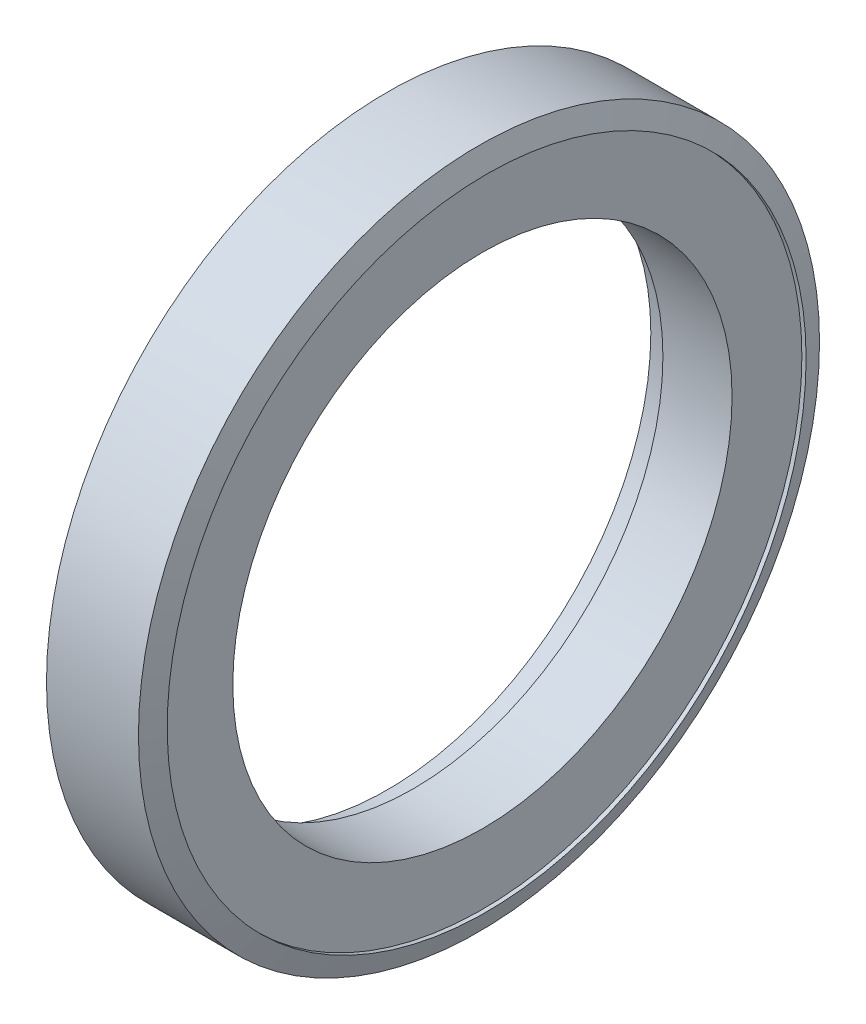
ISO-10303-21;
HEADER;
FILE_DESCRIPTION(('STEP AP214'),'2;1');
FILE_NAME('part.step','',(''),(''),'','','');
FILE_SCHEMA(('AUTOMOTIVE_DESIGN { 1 0 10303 214 1 1 1 1 }'));
ENDSEC;
DATA;
#1=APPLICATION_CONTEXT('core data for automotive mechanical design processes');
#2=APPLICATION_PROTOCOL_DEFINITION('international standard','automotive_design',2000,#1);
#3=PRODUCT_CONTEXT('',#1,'mechanical');
#4=PRODUCT('Part','Part','',(#3));
#5=PRODUCT_RELATED_PRODUCT_CATEGORY('part','',(#4));
#6=PRODUCT_DEFINITION_FORMATION('','',#4);
#7=PRODUCT_DEFINITION_CONTEXT('part definition',#1,'design');
#8=PRODUCT_DEFINITION('design','',#6,#7);
#9=PRODUCT_DEFINITION_SHAPE('','',#8);
#10=(LENGTH_UNIT() NAMED_UNIT(*) SI_UNIT(.MILLI.,.METRE.));
#11=(NAMED_UNIT(*) PLANE_ANGLE_UNIT() SI_UNIT($,.RADIAN.));
#12=(NAMED_UNIT(*) SI_UNIT($,.STERADIAN.) SOLID_ANGLE_UNIT());
#13=UNCERTAINTY_MEASURE_WITH_UNIT(LENGTH_MEASURE(1.E-05),#10,'distance_accuracy_value','');
#14=(GEOMETRIC_REPRESENTATION_CONTEXT(3) GLOBAL_UNCERTAINTY_ASSIGNED_CONTEXT((#13)) GLOBAL_UNIT_ASSIGNED_CONTEXT((#10,
#11,#12)) REPRESENTATION_CONTEXT('',''));
#15=CARTESIAN_POINT('',(0.,0.,0.));
#16=DIRECTION('',(0.,0.,1.));
#17=DIRECTION('',(1.,0.,0.));
#18=AXIS2_PLACEMENT_3D('',#15,#16,#17);
#19=CARTESIAN_POINT('',(7.3524999999999,0.,0.));
#20=DIRECTION('',(1.,0.,0.));
#21=DIRECTION('',(0.,0.,-1.));
#22=AXIS2_PLACEMENT_3D('',#19,#20,#21);
#23=CYLINDRICAL_SURFACE('',#22,30.1625);
#24=CARTESIAN_POINT('',(11.5299999999998,0.,0.));
#25=DIRECTION('',(1.,0.,0.));
#26=DIRECTION('',(0.,0.,-1.));
#27=AXIS2_PLACEMENT_3D('',#24,#25,#26);
#28=CIRCLE('',#27,30.1625);
#29=CARTESIAN_POINT('',(11.5299999999998,0.,-30.1625));
#30=VERTEX_POINT('',#29);
#31=EDGE_CURVE('E17',#30,#30,#28,.F.);
#32=ORIENTED_EDGE('',*,*,#31,.F.);
#33=EDGE_LOOP('',(#32));
#34=FACE_BOUND('',#33,.T.);
#35=CARTESIAN_POINT('',(3.17500000000005,0.,0.));
#36=DIRECTION('',(1.,0.,0.));
#37=DIRECTION('',(0.,0.,-1.));
#38=AXIS2_PLACEMENT_3D('',#35,#36,#37);
#39=CIRCLE('',#38,30.1625);
#40=CARTESIAN_POINT('',(3.17500000000005,0.,-30.1625));
#41=VERTEX_POINT('',#40);
#42=EDGE_CURVE('E40',#41,#41,#39,.T.);
#43=ORIENTED_EDGE('',*,*,#42,.F.);
#44=EDGE_LOOP('',(#43));
#45=FACE_BOUND('',#44,.T.);
#46=ADVANCED_FACE('F14',(#34,#45),#23,.F.);
#47=CARTESIAN_POINT('',(11.5299999999997,34.3812499999992,0.));
#48=DIRECTION('',(1.,0.,0.));
#49=DIRECTION('',(0.,0.,-1.));
#50=AXIS2_PLACEMENT_3D('',#47,#48,#49);
#51=PLANE('',#50);
#52=ORIENTED_EDGE('',*,*,#31,.T.);
#53=EDGE_LOOP('',(#52));
#54=FACE_BOUND('',#53,.T.);
#55=CARTESIAN_POINT('',(11.5299999999997,0.,0.));
#56=DIRECTION('',(1.,0.,0.));
#57=DIRECTION('',(0.,0.,-1.));
#58=AXIS2_PLACEMENT_3D('',#55,#56,#57);
#59=CIRCLE('',#58,38.5999999999985);
#60=CARTESIAN_POINT('',(11.5299999999997,0.,-38.5999999999985));
#61=VERTEX_POINT('',#60);
#62=EDGE_CURVE('E38',#61,#61,#59,.T.);
#63=ORIENTED_EDGE('',*,*,#62,.T.);
#64=EDGE_LOOP('',(#63));
#65=FACE_BOUND('',#64,.T.);
#66=ADVANCED_FACE('F47',(#54,#65),#51,.T.);
#67=CARTESIAN_POINT('',(3.17500000000005,31.01975,0.));
#68=DIRECTION('',(-1.,0.,0.));
#69=DIRECTION('',(0.,0.,1.));
#70=AXIS2_PLACEMENT_3D('',#67,#68,#69);
#71=PLANE('',#70);
#72=ORIENTED_EDGE('',*,*,#42,.T.);
#73=EDGE_LOOP('',(#72));
#74=FACE_BOUND('',#73,.T.);
#75=CARTESIAN_POINT('',(3.17500000000005,0.,0.));
#76=DIRECTION('',(1.,0.,0.));
#77=DIRECTION('',(0.,0.,-1.));
#78=AXIS2_PLACEMENT_3D('',#75,#76,#77);
#79=CIRCLE('',#78,31.877);
#80=CARTESIAN_POINT('',(3.17500000000005,0.,-31.877));
#81=VERTEX_POINT('',#80);
#82=EDGE_CURVE('E35',#81,#81,#79,.F.);
#83=ORIENTED_EDGE('',*,*,#82,.T.);
#84=EDGE_LOOP('',(#83));
#85=FACE_BOUND('',#84,.T.);
#86=ADVANCED_FACE('F56',(#74,#85),#71,.T.);
#87=CARTESIAN_POINT('',(11.7849999999998,0.,0.));
#88=DIRECTION('',(1.,0.,0.));
#89=DIRECTION('',(0.,0.,-1.));
#90=AXIS2_PLACEMENT_3D('',#87,#88,#89);
#91=CYLINDRICAL_SURFACE('',#90,38.5999999999985);
#92=CARTESIAN_POINT('',(12.0400000017785,0.,0.));
#93=DIRECTION('',(-1.,0.,0.));
#94=DIRECTION('',(0.,1.,0.));
#95=AXIS2_PLACEMENT_3D('',#92,#93,#94);
#96=CIRCLE('',#95,38.6000000006458);
#97=CARTESIAN_POINT('',(12.0400000017785,38.6000000006458,0.));
#98=VERTEX_POINT('',#97);
#99=EDGE_CURVE('E34',#98,#98,#96,.T.);
#100=ORIENTED_EDGE('',*,*,#99,.F.);
#101=EDGE_LOOP('',(#100));
#102=FACE_BOUND('',#101,.T.);
#103=ORIENTED_EDGE('',*,*,#62,.F.);
#104=EDGE_LOOP('',(#103));
#105=FACE_BOUND('',#104,.T.);
#106=ADVANCED_FACE('F75',(#102,#105),#91,.F.);
#107=CARTESIAN_POINT('',(1.58750000000003,0.,0.));
#108=DIRECTION('',(1.,0.,0.));
#109=DIRECTION('',(0.,0.,-1.));
#110=AXIS2_PLACEMENT_3D('',#107,#108,#109);
#111=CYLINDRICAL_SURFACE('',#110,31.877);
#112=ORIENTED_EDGE('',*,*,#82,.F.);
#113=EDGE_LOOP('',(#112));
#114=FACE_BOUND('',#113,.T.);
#115=CARTESIAN_POINT('',(0.,0.,0.));
#116=DIRECTION('',(1.,0.,0.));
#117=DIRECTION('',(0.,0.,-1.));
#118=AXIS2_PLACEMENT_3D('',#115,#116,#117);
#119=CIRCLE('',#118,31.877);
#120=CARTESIAN_POINT('',(0.,0.,-31.877));
#121=VERTEX_POINT('',#120);
#122=EDGE_CURVE('E26',#121,#121,#119,.T.);
#123=ORIENTED_EDGE('',*,*,#122,.F.);
#124=EDGE_LOOP('',(#123));
#125=FACE_BOUND('',#124,.T.);
#126=ADVANCED_FACE('F71',(#114,#125),#111,.F.);
#127=CARTESIAN_POINT('',(11.1126038413105,0.,0.));
#128=DIRECTION('',(-1.,0.,0.));
#129=DIRECTION('',(0.,0.,1.));
#130=AXIS2_PLACEMENT_3D('',#127,#128,#129);
#131=CONICAL_SURFACE('',#130,41.1479999993527,1.221730475);
#132=CARTESIAN_POINT('',(11.1126038430891,0.,0.));
#133=DIRECTION('',(1.,0.,0.));
#134=DIRECTION('',(0.,0.,-1.));
#135=AXIS2_PLACEMENT_3D('',#132,#133,#134);
#136=CIRCLE('',#135,41.148);
#137=CARTESIAN_POINT('',(11.1126038430891,0.,-41.148));
#138=VERTEX_POINT('',#137);
#139=EDGE_CURVE('E21',#138,#138,#136,.F.);
#140=ORIENTED_EDGE('',*,*,#139,.F.);
#141=EDGE_LOOP('',(#140));
#142=FACE_BOUND('',#141,.T.);
#143=ORIENTED_EDGE('',*,*,#99,.T.);
#144=EDGE_LOOP('',(#143));
#145=FACE_BOUND('',#144,.T.);
#146=ADVANCED_FACE('F64',(#142,#145),#131,.T.);
#147=CARTESIAN_POINT('',(0.,36.5125,0.));
#148=DIRECTION('',(-1.,0.,0.));
#149=DIRECTION('',(0.,0.,1.));
#150=AXIS2_PLACEMENT_3D('',#147,#148,#149);
#151=PLANE('',#150);
#152=ORIENTED_EDGE('',*,*,#122,.T.);
#153=EDGE_LOOP('',(#152));
#154=FACE_BOUND('',#153,.T.);
#155=CARTESIAN_POINT('',(0.,0.,0.));
#156=DIRECTION('',(1.,0.,0.));
#157=DIRECTION('',(0.,0.,-1.));
#158=AXIS2_PLACEMENT_3D('',#155,#156,#157);
#159=CIRCLE('',#158,41.148);
#160=CARTESIAN_POINT('',(0.,0.,-41.148));
#161=VERTEX_POINT('',#160);
#162=EDGE_CURVE('E10',#161,#161,#159,.T.);
#163=ORIENTED_EDGE('',*,*,#162,.F.);
#164=EDGE_LOOP('',(#163));
#165=FACE_BOUND('',#164,.T.);
#166=ADVANCED_FACE('F59',(#154,#165),#151,.T.);
#167=CARTESIAN_POINT('',(5.55630192154452,0.,0.));
#168=DIRECTION('',(1.,0.,0.));
#169=DIRECTION('',(0.,0.,-1.));
#170=AXIS2_PLACEMENT_3D('',#167,#168,#169);
#171=CYLINDRICAL_SURFACE('',#170,41.148);
#172=ORIENTED_EDGE('',*,*,#162,.T.);
#173=EDGE_LOOP('',(#172));
#174=FACE_BOUND('',#173,.T.);
#175=ORIENTED_EDGE('',*,*,#139,.T.);
#176=EDGE_LOOP('',(#175));
#177=FACE_BOUND('',#176,.T.);
#178=ADVANCED_FACE('F57',(#174,#177),#171,.T.);
#179=CLOSED_SHELL('',(#46,#66,#86,#106,#126,#146,#166,#178));
#180=MANIFOLD_SOLID_BREP('B1',#179);
#181=ADVANCED_BREP_SHAPE_REPRESENTATION('',(#18,#180),#14);
#182=SHAPE_DEFINITION_REPRESENTATION(#9,#181);
ENDSEC;
END-ISO-10303-21;
